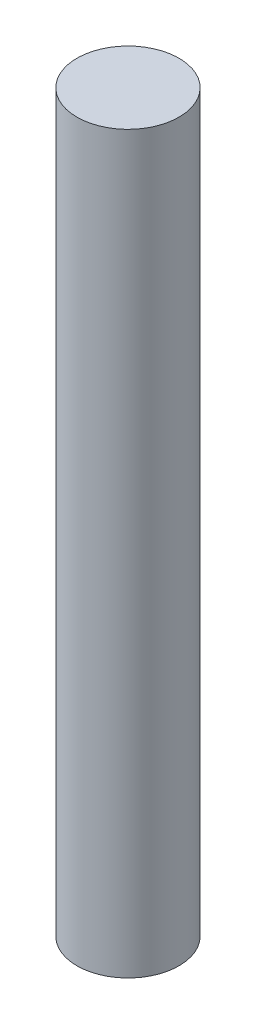
ISO-10303-21;
HEADER;
FILE_DESCRIPTION(('STEP AP214'),'2;1');
FILE_NAME('part.step','',(''),(''),'','','');
FILE_SCHEMA(('AUTOMOTIVE_DESIGN { 1 0 10303 214 1 1 1 1 }'));
ENDSEC;
DATA;
#1=APPLICATION_CONTEXT('core data for automotive mechanical design processes');
#2=APPLICATION_PROTOCOL_DEFINITION('international standard','automotive_design',2000,#1);
#3=PRODUCT_CONTEXT('',#1,'mechanical');
#4=PRODUCT('Part','Part','',(#3));
#5=PRODUCT_RELATED_PRODUCT_CATEGORY('part','',(#4));
#6=PRODUCT_DEFINITION_FORMATION('','',#4);
#7=PRODUCT_DEFINITION_CONTEXT('part definition',#1,'design');
#8=PRODUCT_DEFINITION('design','',#6,#7);
#9=PRODUCT_DEFINITION_SHAPE('','',#8);
#10=(LENGTH_UNIT() NAMED_UNIT(*) SI_UNIT(.MILLI.,.METRE.));
#11=(NAMED_UNIT(*) PLANE_ANGLE_UNIT() SI_UNIT($,.RADIAN.));
#12=(NAMED_UNIT(*) SI_UNIT($,.STERADIAN.) SOLID_ANGLE_UNIT());
#13=UNCERTAINTY_MEASURE_WITH_UNIT(LENGTH_MEASURE(1.E-05),#10,'distance_accuracy_value','');
#14=(GEOMETRIC_REPRESENTATION_CONTEXT(3) GLOBAL_UNCERTAINTY_ASSIGNED_CONTEXT((#13)) GLOBAL_UNIT_ASSIGNED_CONTEXT((#10,
#11,#12)) REPRESENTATION_CONTEXT('',''));
#15=CARTESIAN_POINT('',(0.,0.,0.));
#16=DIRECTION('',(0.,0.,1.));
#17=DIRECTION('',(1.,0.,0.));
#18=AXIS2_PLACEMENT_3D('',#15,#16,#17);
#19=CARTESIAN_POINT('',(0.,90.,0.));
#20=DIRECTION('',(0.,-1.,0.));
#21=DIRECTION('',(0.,0.,-1.));
#22=AXIS2_PLACEMENT_3D('',#19,#20,#21);
#23=CYLINDRICAL_SURFACE('',#22,12.5);
#24=CARTESIAN_POINT('',(0.,90.,0.));
#25=DIRECTION('',(0.,1.,0.));
#26=DIRECTION('',(0.,0.,1.));
#27=AXIS2_PLACEMENT_3D('',#24,#25,#26);
#28=CIRCLE('',#27,12.5);
#29=CARTESIAN_POINT('',(0.,90.,12.5));
#30=VERTEX_POINT('',#29);
#31=EDGE_CURVE('E10',#30,#30,#28,.T.);
#32=ORIENTED_EDGE('',*,*,#31,.F.);
#33=EDGE_LOOP('',(#32));
#34=FACE_BOUND('',#33,.T.);
#35=CARTESIAN_POINT('',(0.,-90.,0.));
#36=DIRECTION('',(0.,1.,0.));
#37=DIRECTION('',(0.,0.,1.));
#38=AXIS2_PLACEMENT_3D('',#35,#36,#37);
#39=CIRCLE('',#38,12.5);
#40=CARTESIAN_POINT('',(0.,-90.,12.5));
#41=VERTEX_POINT('',#40);
#42=EDGE_CURVE('E34',#41,#41,#39,.T.);
#43=ORIENTED_EDGE('',*,*,#42,.T.);
#44=EDGE_LOOP('',(#43));
#45=FACE_BOUND('',#44,.T.);
#46=ADVANCED_FACE('F31',(#34,#45),#23,.T.);
#47=CARTESIAN_POINT('',(0.,90.,0.));
#48=DIRECTION('',(0.,1.,0.));
#49=DIRECTION('',(0.,0.,1.));
#50=AXIS2_PLACEMENT_3D('',#47,#48,#49);
#51=PLANE('',#50);
#52=ORIENTED_EDGE('',*,*,#31,.T.);
#53=EDGE_LOOP('',(#52));
#54=FACE_BOUND('',#53,.T.);
#55=ADVANCED_FACE('F46',(#54),#51,.T.);
#56=CARTESIAN_POINT('',(0.,-90.,0.));
#57=DIRECTION('',(0.,1.,0.));
#58=DIRECTION('',(0.,0.,1.));
#59=AXIS2_PLACEMENT_3D('',#56,#57,#58);
#60=PLANE('',#59);
#61=ORIENTED_EDGE('',*,*,#42,.F.);
#62=EDGE_LOOP('',(#61));
#63=FACE_BOUND('',#62,.T.);
#64=ADVANCED_FACE('F44',(#63),#60,.F.);
#65=CLOSED_SHELL('',(#46,#55,#64));
#66=MANIFOLD_SOLID_BREP('B2',#65);
#67=ADVANCED_BREP_SHAPE_REPRESENTATION('',(#18,#66),#14);
#68=SHAPE_DEFINITION_REPRESENTATION(#9,#67);
ENDSEC;
END-ISO-10303-21;
